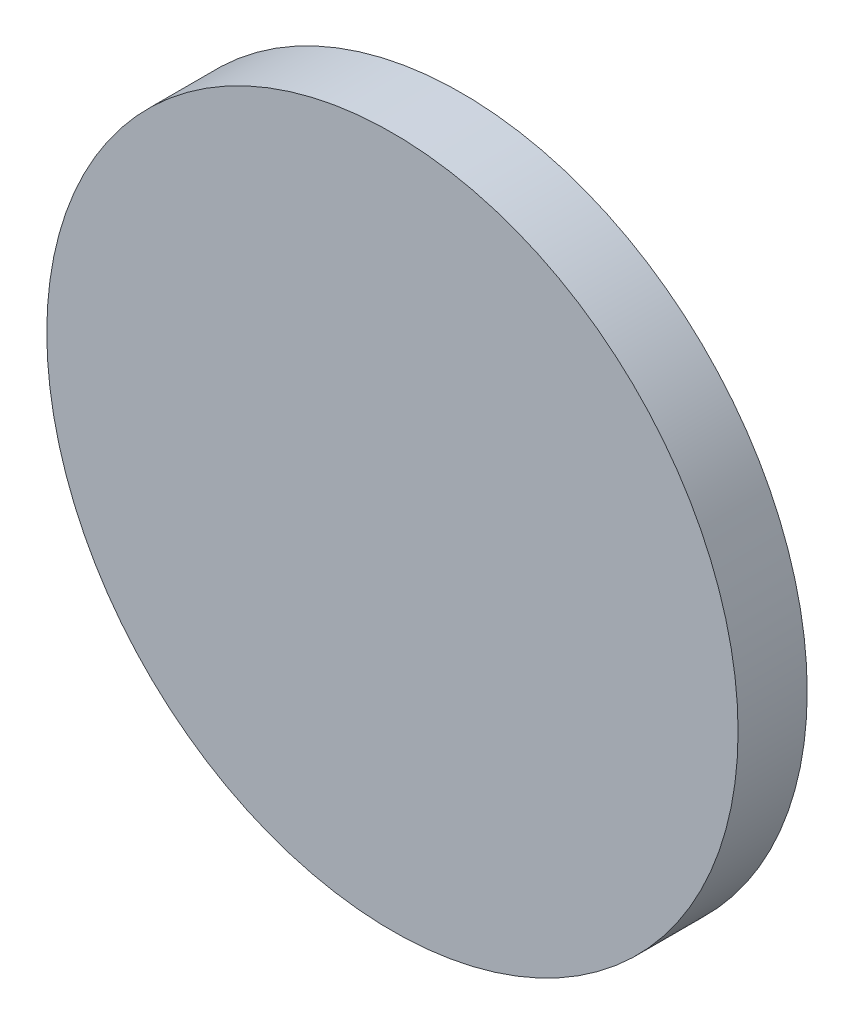
ISO-10303-21;
HEADER;
FILE_DESCRIPTION(('STEP AP214'),'2;1');
FILE_NAME('part.step','',(''),(''),'','','');
FILE_SCHEMA(('AUTOMOTIVE_DESIGN { 1 0 10303 214 1 1 1 1 }'));
ENDSEC;
DATA;
#1=APPLICATION_CONTEXT('core data for automotive mechanical design processes');
#2=APPLICATION_PROTOCOL_DEFINITION('international standard','automotive_design',2000,#1);
#3=PRODUCT_CONTEXT('',#1,'mechanical');
#4=PRODUCT('Part','Part','',(#3));
#5=PRODUCT_RELATED_PRODUCT_CATEGORY('part','',(#4));
#6=PRODUCT_DEFINITION_FORMATION('','',#4);
#7=PRODUCT_DEFINITION_CONTEXT('part definition',#1,'design');
#8=PRODUCT_DEFINITION('design','',#6,#7);
#9=PRODUCT_DEFINITION_SHAPE('','',#8);
#10=(LENGTH_UNIT() NAMED_UNIT(*) SI_UNIT(.MILLI.,.METRE.));
#11=(NAMED_UNIT(*) PLANE_ANGLE_UNIT() SI_UNIT($,.RADIAN.));
#12=(NAMED_UNIT(*) SI_UNIT($,.STERADIAN.) SOLID_ANGLE_UNIT());
#13=UNCERTAINTY_MEASURE_WITH_UNIT(LENGTH_MEASURE(1.E-05),#10,'distance_accuracy_value','');
#14=(GEOMETRIC_REPRESENTATION_CONTEXT(3) GLOBAL_UNCERTAINTY_ASSIGNED_CONTEXT((#13)) GLOBAL_UNIT_ASSIGNED_CONTEXT((#10,
#11,#12)) REPRESENTATION_CONTEXT('',''));
#15=CARTESIAN_POINT('',(0.,0.,0.));
#16=DIRECTION('',(0.,0.,1.));
#17=DIRECTION('',(1.,0.,0.));
#18=AXIS2_PLACEMENT_3D('',#15,#16,#17);
#19=CARTESIAN_POINT('',(0.,0.,5.));
#20=DIRECTION('',(0.,0.,-1.));
#21=DIRECTION('',(-1.,0.,0.));
#22=AXIS2_PLACEMENT_3D('',#19,#20,#21);
#23=CYLINDRICAL_SURFACE('',#22,25.);
#24=CARTESIAN_POINT('',(0.,0.,5.));
#25=DIRECTION('',(0.,0.,1.));
#26=DIRECTION('',(1.,0.,0.));
#27=AXIS2_PLACEMENT_3D('',#24,#25,#26);
#28=CIRCLE('',#27,25.);
#29=CARTESIAN_POINT('',(25.,0.,5.));
#30=VERTEX_POINT('',#29);
#31=EDGE_CURVE('E10',#30,#30,#28,.T.);
#32=ORIENTED_EDGE('',*,*,#31,.F.);
#33=EDGE_LOOP('',(#32));
#34=FACE_BOUND('',#33,.T.);
#35=CARTESIAN_POINT('',(0.,0.,0.));
#36=DIRECTION('',(0.,0.,1.));
#37=DIRECTION('',(1.,0.,0.));
#38=AXIS2_PLACEMENT_3D('',#35,#36,#37);
#39=CIRCLE('',#38,25.);
#40=CARTESIAN_POINT('',(25.,0.,0.));
#41=VERTEX_POINT('',#40);
#42=EDGE_CURVE('E38',#41,#41,#39,.T.);
#43=ORIENTED_EDGE('',*,*,#42,.T.);
#44=EDGE_LOOP('',(#43));
#45=FACE_BOUND('',#44,.T.);
#46=ADVANCED_FACE('F35',(#34,#45),#23,.T.);
#47=CARTESIAN_POINT('',(0.,0.,5.));
#48=DIRECTION('',(0.,0.,1.));
#49=DIRECTION('',(1.,0.,0.));
#50=AXIS2_PLACEMENT_3D('',#47,#48,#49);
#51=PLANE('',#50);
#52=ORIENTED_EDGE('',*,*,#31,.T.);
#53=EDGE_LOOP('',(#52));
#54=FACE_BOUND('',#53,.T.);
#55=ADVANCED_FACE('F50',(#54),#51,.T.);
#56=CARTESIAN_POINT('',(0.,0.,0.));
#57=DIRECTION('',(0.,0.,1.));
#58=DIRECTION('',(1.,0.,0.));
#59=AXIS2_PLACEMENT_3D('',#56,#57,#58);
#60=PLANE('',#59);
#61=ORIENTED_EDGE('',*,*,#42,.F.);
#62=EDGE_LOOP('',(#61));
#63=FACE_BOUND('',#62,.T.);
#64=ADVANCED_FACE('F48',(#63),#60,.F.);
#65=CLOSED_SHELL('',(#46,#55,#64));
#66=MANIFOLD_SOLID_BREP('B2',#65);
#67=ADVANCED_BREP_SHAPE_REPRESENTATION('',(#18,#66),#14);
#68=SHAPE_DEFINITION_REPRESENTATION(#9,#67);
ENDSEC;
END-ISO-10303-21;
